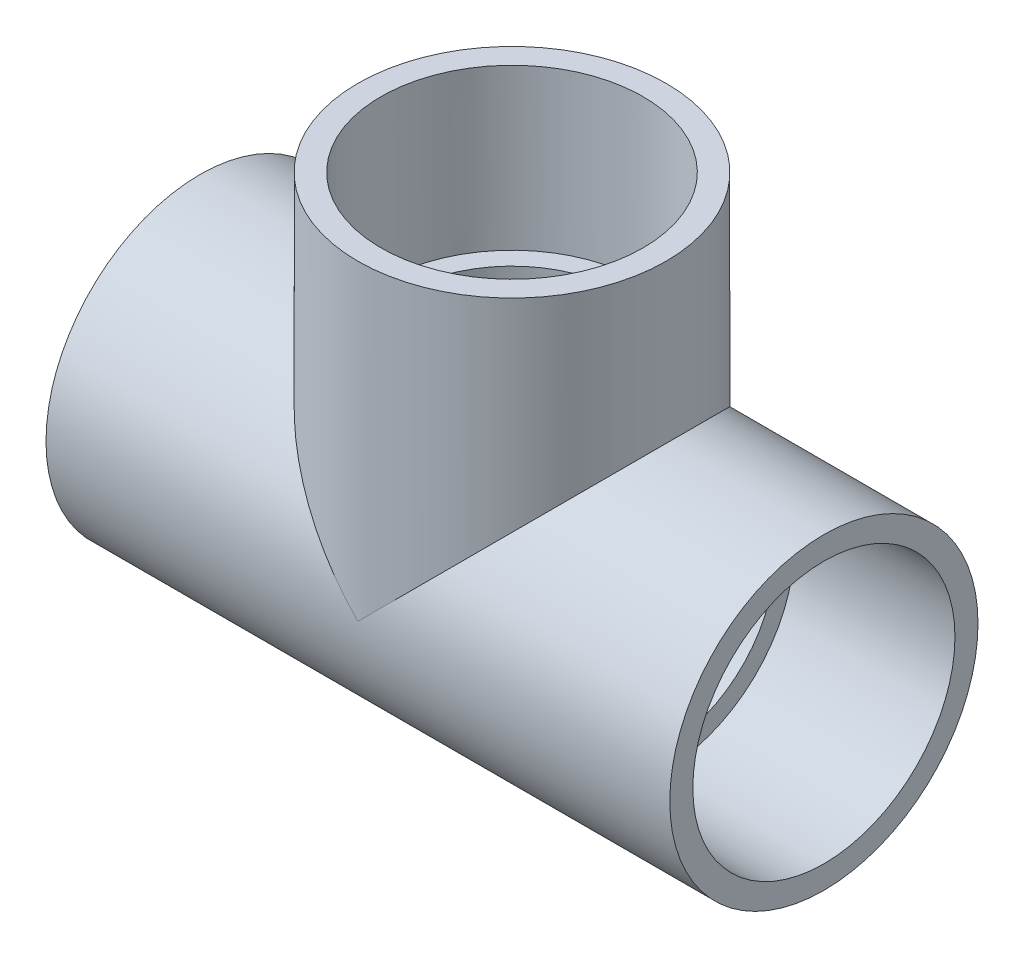
ISO-10303-21;
HEADER;
FILE_DESCRIPTION(('STEP AP214'),'2;1');
FILE_NAME('part.step','',(''),(''),'','','');
FILE_SCHEMA(('AUTOMOTIVE_DESIGN { 1 0 10303 214 1 1 1 1 }'));
ENDSEC;
DATA;
#1=APPLICATION_CONTEXT('core data for automotive mechanical design processes');
#2=APPLICATION_PROTOCOL_DEFINITION('international standard','automotive_design',2000,#1);
#3=PRODUCT_CONTEXT('',#1,'mechanical');
#4=PRODUCT('Part','Part','',(#3));
#5=PRODUCT_RELATED_PRODUCT_CATEGORY('part','',(#4));
#6=PRODUCT_DEFINITION_FORMATION('','',#4);
#7=PRODUCT_DEFINITION_CONTEXT('part definition',#1,'design');
#8=PRODUCT_DEFINITION('design','',#6,#7);
#9=PRODUCT_DEFINITION_SHAPE('','',#8);
#10=(LENGTH_UNIT() NAMED_UNIT(*) SI_UNIT(.MILLI.,.METRE.));
#11=(NAMED_UNIT(*) PLANE_ANGLE_UNIT() SI_UNIT($,.RADIAN.));
#12=(NAMED_UNIT(*) SI_UNIT($,.STERADIAN.) SOLID_ANGLE_UNIT());
#13=UNCERTAINTY_MEASURE_WITH_UNIT(LENGTH_MEASURE(1.E-05),#10,'distance_accuracy_value','');
#14=(GEOMETRIC_REPRESENTATION_CONTEXT(3) GLOBAL_UNCERTAINTY_ASSIGNED_CONTEXT((#13)) GLOBAL_UNIT_ASSIGNED_CONTEXT((#10,
#11,#12)) REPRESENTATION_CONTEXT('',''));
#15=CARTESIAN_POINT('',(0.,0.,0.));
#16=DIRECTION('',(0.,0.,1.));
#17=DIRECTION('',(1.,0.,0.));
#18=AXIS2_PLACEMENT_3D('',#15,#16,#17);
#19=CARTESIAN_POINT('',(-28.2702,0.,0.));
#20=DIRECTION('',(1.,0.,0.));
#21=DIRECTION('',(0.,0.,-1.));
#22=AXIS2_PLACEMENT_3D('',#19,#20,#21);
#23=PLANE('',#22);
#24=CARTESIAN_POINT('',(-28.2702,0.,0.));
#25=DIRECTION('',(-1.,0.,0.));
#26=DIRECTION('',(0.,0.,1.));
#27=AXIS2_PLACEMENT_3D('',#24,#25,#26);
#28=CIRCLE('',#27,24.0538);
#29=CARTESIAN_POINT('',(-28.2702,0.,24.0538));
#30=VERTEX_POINT('',#29);
#31=EDGE_CURVE('E92',#30,#30,#28,.T.);
#32=ORIENTED_EDGE('',*,*,#31,.T.);
#33=EDGE_LOOP('',(#32));
#34=FACE_BOUND('',#33,.T.);
#35=CARTESIAN_POINT('',(-28.2702,0.,0.));
#36=DIRECTION('',(1.,0.,0.));
#37=DIRECTION('',(0.,0.,-1.));
#38=AXIS2_PLACEMENT_3D('',#35,#36,#37);
#39=CIRCLE('',#38,20.447);
#40=CARTESIAN_POINT('',(-28.2702,0.,-20.447));
#41=VERTEX_POINT('',#40);
#42=EDGE_CURVE('E75',#41,#41,#39,.T.);
#43=ORIENTED_EDGE('',*,*,#42,.T.);
#44=EDGE_LOOP('',(#43));
#45=FACE_BOUND('',#44,.T.);
#46=ADVANCED_FACE('F36',(#34,#45),#23,.F.);
#47=CARTESIAN_POINT('',(28.2702,0.,0.));
#48=DIRECTION('',(1.,0.,0.));
#49=DIRECTION('',(0.,0.,-1.));
#50=AXIS2_PLACEMENT_3D('',#47,#48,#49);
#51=PLANE('',#50);
#52=CARTESIAN_POINT('',(28.2702,0.,0.));
#53=DIRECTION('',(1.,0.,0.));
#54=DIRECTION('',(0.,0.,-1.));
#55=AXIS2_PLACEMENT_3D('',#52,#53,#54);
#56=CIRCLE('',#55,20.447);
#57=CARTESIAN_POINT('',(28.2702,0.,-20.447));
#58=VERTEX_POINT('',#57);
#59=EDGE_CURVE('E72',#58,#58,#56,.T.);
#60=ORIENTED_EDGE('',*,*,#59,.F.);
#61=EDGE_LOOP('',(#60));
#62=FACE_BOUND('',#61,.T.);
#63=CARTESIAN_POINT('',(28.2702,0.,0.));
#64=DIRECTION('',(1.,0.,0.));
#65=DIRECTION('',(0.,0.,-1.));
#66=AXIS2_PLACEMENT_3D('',#63,#64,#65);
#67=CIRCLE('',#66,24.0538);
#68=CARTESIAN_POINT('',(28.2702,0.,-24.0538));
#69=VERTEX_POINT('',#68);
#70=EDGE_CURVE('E63',#69,#69,#67,.F.);
#71=ORIENTED_EDGE('',*,*,#70,.F.);
#72=EDGE_LOOP('',(#71));
#73=FACE_BOUND('',#72,.T.);
#74=ADVANCED_FACE('F114',(#62,#73),#51,.T.);
#75=CARTESIAN_POINT('',(28.2702,0.,0.));
#76=DIRECTION('',(-1.,0.,0.));
#77=DIRECTION('',(0.,0.,1.));
#78=AXIS2_PLACEMENT_3D('',#75,#76,#77);
#79=CYLINDRICAL_SURFACE('',#78,28.5496);
#80=CARTESIAN_POINT('',(-57.785,0.,0.));
#81=DIRECTION('',(-1.,0.,0.));
#82=DIRECTION('',(0.,0.,1.));
#83=AXIS2_PLACEMENT_3D('',#80,#81,#82);
#84=CIRCLE('',#83,28.5496);
#85=CARTESIAN_POINT('',(-57.785,0.,28.5496));
#86=VERTEX_POINT('',#85);
#87=EDGE_CURVE('E89',#86,#86,#84,.T.);
#88=ORIENTED_EDGE('',*,*,#87,.F.);
#89=EDGE_LOOP('',(#88));
#90=FACE_BOUND('',#89,.T.);
#91=CARTESIAN_POINT('',(57.785,0.,0.));
#92=DIRECTION('',(-1.,0.,0.));
#93=DIRECTION('',(0.,0.,1.));
#94=AXIS2_PLACEMENT_3D('',#91,#92,#93);
#95=CIRCLE('',#94,28.5496);
#96=CARTESIAN_POINT('',(57.785,0.,28.5496));
#97=VERTEX_POINT('',#96);
#98=EDGE_CURVE('E77',#97,#97,#95,.T.);
#99=ORIENTED_EDGE('',*,*,#98,.T.);
#100=EDGE_LOOP('',(#99));
#101=FACE_BOUND('',#100,.T.);
#102=CARTESIAN_POINT('',(0.,0.,0.));
#103=DIRECTION('',(-0.707106781186547,-0.707106781186547,0.));
#104=DIRECTION('',(0.707106781186547,-0.707106781186547,0.));
#105=AXIS2_PLACEMENT_3D('',#102,#103,#104);
#106=ELLIPSE('',#105,40.3752315203269,28.5496);
#107=CARTESIAN_POINT('',(0.,0.,28.5496));
#108=VERTEX_POINT('',#107);
#109=CARTESIAN_POINT('',(0.,0.,-28.5496));
#110=VERTEX_POINT('',#109);
#111=EDGE_CURVE('E98',#108,#110,#106,.T.);
#112=ORIENTED_EDGE('',*,*,#111,.T.);
#113=CARTESIAN_POINT('',(0.,0.,0.));
#114=DIRECTION('',(0.707106781186547,-0.707106781186547,0.));
#115=DIRECTION('',(-0.707106781186547,-0.707106781186547,0.));
#116=AXIS2_PLACEMENT_3D('',#113,#114,#115);
#117=ELLIPSE('',#116,40.3752315203269,28.5496);
#118=EDGE_CURVE('E55',#110,#108,#117,.T.);
#119=ORIENTED_EDGE('',*,*,#118,.T.);
#120=EDGE_LOOP('',(#112,#119));
#121=FACE_BOUND('',#120,.T.);
#122=ADVANCED_FACE('F116',(#90,#101,#121),#79,.T.);
#123=CARTESIAN_POINT('',(-28.2702,0.,0.));
#124=DIRECTION('',(-1.,0.,0.));
#125=DIRECTION('',(0.,0.,1.));
#126=AXIS2_PLACEMENT_3D('',#123,#124,#125);
#127=CONICAL_SURFACE('',#126,24.0538,0.0077451119096428);
#128=CARTESIAN_POINT('',(-57.785,0.,0.));
#129=DIRECTION('',(-1.,0.,0.));
#130=DIRECTION('',(0.,0.,1.));
#131=AXIS2_PLACEMENT_3D('',#128,#129,#130);
#132=CIRCLE('',#131,24.2824);
#133=CARTESIAN_POINT('',(-57.785,0.,24.2824));
#134=VERTEX_POINT('',#133);
#135=EDGE_CURVE('E95',#134,#134,#132,.T.);
#136=ORIENTED_EDGE('',*,*,#135,.T.);
#137=EDGE_LOOP('',(#136));
#138=FACE_BOUND('',#137,.T.);
#139=ORIENTED_EDGE('',*,*,#31,.F.);
#140=EDGE_LOOP('',(#139));
#141=FACE_BOUND('',#140,.T.);
#142=ADVANCED_FACE('F123',(#138,#141),#127,.F.);
#143=CARTESIAN_POINT('',(57.785,0.,0.));
#144=DIRECTION('',(1.,0.,0.));
#145=DIRECTION('',(0.,0.,-1.));
#146=AXIS2_PLACEMENT_3D('',#143,#144,#145);
#147=CONICAL_SURFACE('',#146,24.2824,0.00774511190964257);
#148=CARTESIAN_POINT('',(57.785,0.,0.));
#149=DIRECTION('',(-1.,0.,0.));
#150=DIRECTION('',(0.,0.,1.));
#151=AXIS2_PLACEMENT_3D('',#148,#149,#150);
#152=CIRCLE('',#151,24.2824);
#153=CARTESIAN_POINT('',(57.785,0.,24.2824));
#154=VERTEX_POINT('',#153);
#155=EDGE_CURVE('E80',#154,#154,#152,.T.);
#156=ORIENTED_EDGE('',*,*,#155,.F.);
#157=EDGE_LOOP('',(#156));
#158=FACE_BOUND('',#157,.T.);
#159=ORIENTED_EDGE('',*,*,#70,.T.);
#160=EDGE_LOOP('',(#159));
#161=FACE_BOUND('',#160,.T.);
#162=ADVANCED_FACE('F112',(#158,#161),#147,.F.);
#163=CARTESIAN_POINT('',(0.,57.785,0.));
#164=DIRECTION('',(0.,1.,0.));
#165=DIRECTION('',(-1.,0.,0.));
#166=AXIS2_PLACEMENT_3D('',#163,#164,#165);
#167=CONICAL_SURFACE('',#166,24.2824,0.0077451119096428);
#168=CARTESIAN_POINT('',(0.,57.785,0.));
#169=DIRECTION('',(0.,-1.,0.));
#170=DIRECTION('',(1.,0.,0.));
#171=AXIS2_PLACEMENT_3D('',#168,#169,#170);
#172=CIRCLE('',#171,24.2824);
#173=CARTESIAN_POINT('',(24.2824,57.785,0.));
#174=VERTEX_POINT('',#173);
#175=EDGE_CURVE('E100',#174,#174,#172,.T.);
#176=ORIENTED_EDGE('',*,*,#175,.F.);
#177=EDGE_LOOP('',(#176));
#178=FACE_BOUND('',#177,.T.);
#179=CARTESIAN_POINT('',(0.,28.2702,0.));
#180=DIRECTION('',(0.,-1.,0.));
#181=DIRECTION('',(1.,0.,0.));
#182=AXIS2_PLACEMENT_3D('',#179,#180,#181);
#183=CIRCLE('',#182,24.0538);
#184=CARTESIAN_POINT('',(24.0538,28.2702,0.));
#185=VERTEX_POINT('',#184);
#186=EDGE_CURVE('E103',#185,#185,#183,.T.);
#187=ORIENTED_EDGE('',*,*,#186,.T.);
#188=EDGE_LOOP('',(#187));
#189=FACE_BOUND('',#188,.T.);
#190=ADVANCED_FACE('F132',(#178,#189),#167,.F.);
#191=CARTESIAN_POINT('',(28.5496,57.785,0.));
#192=DIRECTION('',(0.,1.,0.));
#193=DIRECTION('',(-1.,0.,0.));
#194=AXIS2_PLACEMENT_3D('',#191,#192,#193);
#195=PLANE('',#194);
#196=ORIENTED_EDGE('',*,*,#175,.T.);
#197=EDGE_LOOP('',(#196));
#198=FACE_BOUND('',#197,.T.);
#199=CARTESIAN_POINT('',(0.,57.785,0.));
#200=DIRECTION('',(0.,-1.,0.));
#201=DIRECTION('',(1.,0.,0.));
#202=AXIS2_PLACEMENT_3D('',#199,#200,#201);
#203=CIRCLE('',#202,28.5496);
#204=CARTESIAN_POINT('',(28.5496,57.785,0.));
#205=VERTEX_POINT('',#204);
#206=EDGE_CURVE('E106',#205,#205,#203,.T.);
#207=ORIENTED_EDGE('',*,*,#206,.F.);
#208=EDGE_LOOP('',(#207));
#209=FACE_BOUND('',#208,.T.);
#210=ADVANCED_FACE('F38',(#198,#209),#195,.T.);
#211=CARTESIAN_POINT('',(0.,0.,0.));
#212=DIRECTION('',(0.,-1.,0.));
#213=DIRECTION('',(1.,0.,0.));
#214=AXIS2_PLACEMENT_3D('',#211,#212,#213);
#215=CYLINDRICAL_SURFACE('',#214,28.5496);
#216=ORIENTED_EDGE('',*,*,#118,.F.);
#217=ORIENTED_EDGE('',*,*,#111,.F.);
#218=EDGE_LOOP('',(#216,#217));
#219=FACE_BOUND('',#218,.T.);
#220=ORIENTED_EDGE('',*,*,#206,.T.);
#221=EDGE_LOOP('',(#220));
#222=FACE_BOUND('',#221,.T.);
#223=ADVANCED_FACE('F135',(#219,#222),#215,.T.);
#224=CARTESIAN_POINT('',(-57.785,-28.5496,0.));
#225=DIRECTION('',(-1.,0.,0.));
#226=DIRECTION('',(0.,0.,1.));
#227=AXIS2_PLACEMENT_3D('',#224,#225,#226);
#228=PLANE('',#227);
#229=ORIENTED_EDGE('',*,*,#87,.T.);
#230=EDGE_LOOP('',(#229));
#231=FACE_BOUND('',#230,.T.);
#232=ORIENTED_EDGE('',*,*,#135,.F.);
#233=EDGE_LOOP('',(#232));
#234=FACE_BOUND('',#233,.T.);
#235=ADVANCED_FACE('F129',(#231,#234),#228,.T.);
#236=CARTESIAN_POINT('',(57.785,-28.5496,0.));
#237=DIRECTION('',(1.,0.,0.));
#238=DIRECTION('',(0.,0.,-1.));
#239=AXIS2_PLACEMENT_3D('',#236,#237,#238);
#240=PLANE('',#239);
#241=ORIENTED_EDGE('',*,*,#155,.T.);
#242=EDGE_LOOP('',(#241));
#243=FACE_BOUND('',#242,.T.);
#244=ORIENTED_EDGE('',*,*,#98,.F.);
#245=EDGE_LOOP('',(#244));
#246=FACE_BOUND('',#245,.T.);
#247=ADVANCED_FACE('F141',(#243,#246),#240,.T.);
#248=CARTESIAN_POINT('',(0.,28.2702,0.));
#249=DIRECTION('',(0.,-1.,0.));
#250=DIRECTION('',(1.,0.,0.));
#251=AXIS2_PLACEMENT_3D('',#248,#249,#250);
#252=PLANE('',#251);
#253=CARTESIAN_POINT('',(0.,28.2702,0.));
#254=DIRECTION('',(0.,-1.,0.));
#255=DIRECTION('',(1.,0.,0.));
#256=AXIS2_PLACEMENT_3D('',#253,#254,#255);
#257=CIRCLE('',#256,20.447);
#258=CARTESIAN_POINT('',(20.447,28.2702,0.));
#259=VERTEX_POINT('',#258);
#260=EDGE_CURVE('E82',#259,#259,#257,.T.);
#261=ORIENTED_EDGE('',*,*,#260,.T.);
#262=EDGE_LOOP('',(#261));
#263=FACE_BOUND('',#262,.T.);
#264=ORIENTED_EDGE('',*,*,#186,.F.);
#265=EDGE_LOOP('',(#264));
#266=FACE_BOUND('',#265,.T.);
#267=ADVANCED_FACE('F67',(#263,#266),#252,.F.);
#268=CARTESIAN_POINT('',(57.785,0.,0.));
#269=DIRECTION('',(1.,0.,0.));
#270=DIRECTION('',(0.,0.,-1.));
#271=AXIS2_PLACEMENT_3D('',#268,#269,#270);
#272=CYLINDRICAL_SURFACE('',#271,20.447);
#273=CARTESIAN_POINT('',(0.,0.,0.));
#274=DIRECTION('',(0.707106781186547,-0.707106781186547,0.));
#275=DIRECTION('',(0.707106781186547,0.707106781186547,0.));
#276=AXIS2_PLACEMENT_3D('',#273,#274,#275);
#277=ELLIPSE('',#276,28.9164247098427,20.447);
#278=CARTESIAN_POINT('',(0.,0.,-20.447));
#279=VERTEX_POINT('',#278);
#280=CARTESIAN_POINT('',(0.,0.,20.447));
#281=VERTEX_POINT('',#280);
#282=EDGE_CURVE('E11',#279,#281,#277,.T.);
#283=ORIENTED_EDGE('',*,*,#282,.F.);
#284=CARTESIAN_POINT('',(0.,0.,0.));
#285=DIRECTION('',(0.707106781186547,0.707106781186547,0.));
#286=DIRECTION('',(0.707106781186547,-0.707106781186547,0.));
#287=AXIS2_PLACEMENT_3D('',#284,#285,#286);
#288=ELLIPSE('',#287,28.9164247098427,20.447);
#289=EDGE_CURVE('E44',#281,#279,#288,.F.);
#290=ORIENTED_EDGE('',*,*,#289,.F.);
#291=EDGE_LOOP('',(#283,#290));
#292=FACE_BOUND('',#291,.T.);
#293=ORIENTED_EDGE('',*,*,#59,.T.);
#294=EDGE_LOOP('',(#293));
#295=FACE_BOUND('',#294,.T.);
#296=ORIENTED_EDGE('',*,*,#42,.F.);
#297=EDGE_LOOP('',(#296));
#298=FACE_BOUND('',#297,.T.);
#299=ADVANCED_FACE('F64',(#292,#295,#298),#272,.F.);
#300=CARTESIAN_POINT('',(0.,0.,0.));
#301=DIRECTION('',(0.,-1.,0.));
#302=DIRECTION('',(1.,0.,0.));
#303=AXIS2_PLACEMENT_3D('',#300,#301,#302);
#304=CYLINDRICAL_SURFACE('',#303,20.447);
#305=ORIENTED_EDGE('',*,*,#282,.T.);
#306=ORIENTED_EDGE('',*,*,#289,.T.);
#307=EDGE_LOOP('',(#305,#306));
#308=FACE_BOUND('',#307,.T.);
#309=ORIENTED_EDGE('',*,*,#260,.F.);
#310=EDGE_LOOP('',(#309));
#311=FACE_BOUND('',#310,.T.);
#312=ADVANCED_FACE('F60',(#308,#311),#304,.F.);
#313=CLOSED_SHELL('',(#46,#74,#122,#142,#162,#190,#210,#223,#235,#247,#267,#299,#312));
#314=MANIFOLD_SOLID_BREP('B2',#313);
#315=ADVANCED_BREP_SHAPE_REPRESENTATION('',(#18,#314),#14);
#316=SHAPE_DEFINITION_REPRESENTATION(#9,#315);
ENDSEC;
END-ISO-10303-21;
